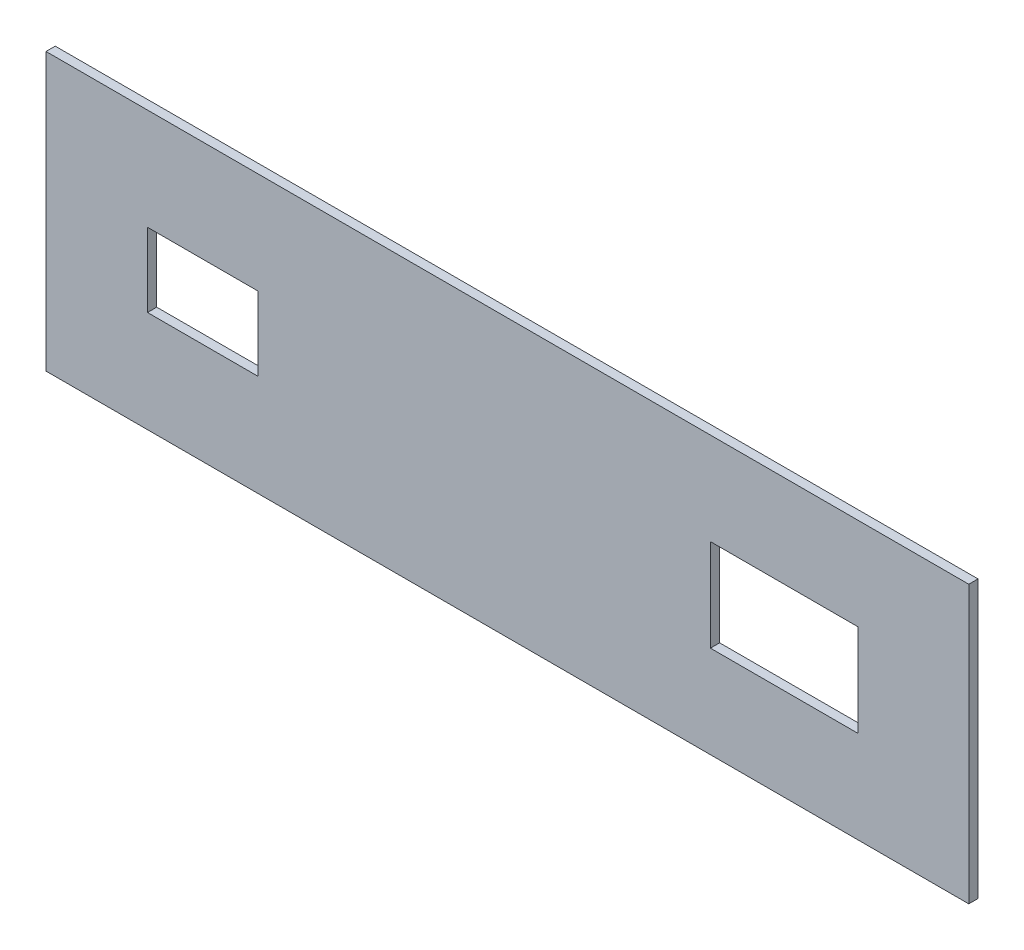
ISO-10303-21;
HEADER;
FILE_DESCRIPTION(('STEP AP214'),'2;1');
FILE_NAME('part.step','',(''),(''),'','','');
FILE_SCHEMA(('AUTOMOTIVE_DESIGN { 1 0 10303 214 1 1 1 1 }'));
ENDSEC;
DATA;
#1=APPLICATION_CONTEXT('core data for automotive mechanical design processes');
#2=APPLICATION_PROTOCOL_DEFINITION('international standard','automotive_design',2000,#1);
#3=PRODUCT_CONTEXT('',#1,'mechanical');
#4=PRODUCT('Part','Part','',(#3));
#5=PRODUCT_RELATED_PRODUCT_CATEGORY('part','',(#4));
#6=PRODUCT_DEFINITION_FORMATION('','',#4);
#7=PRODUCT_DEFINITION_CONTEXT('part definition',#1,'design');
#8=PRODUCT_DEFINITION('design','',#6,#7);
#9=PRODUCT_DEFINITION_SHAPE('','',#8);
#10=(LENGTH_UNIT() NAMED_UNIT(*) SI_UNIT(.MILLI.,.METRE.));
#11=(NAMED_UNIT(*) PLANE_ANGLE_UNIT() SI_UNIT($,.RADIAN.));
#12=(NAMED_UNIT(*) SI_UNIT($,.STERADIAN.) SOLID_ANGLE_UNIT());
#13=UNCERTAINTY_MEASURE_WITH_UNIT(LENGTH_MEASURE(1.E-05),#10,'distance_accuracy_value','');
#14=(GEOMETRIC_REPRESENTATION_CONTEXT(3) GLOBAL_UNCERTAINTY_ASSIGNED_CONTEXT((#13)) GLOBAL_UNIT_ASSIGNED_CONTEXT((#10,
#11,#12)) REPRESENTATION_CONTEXT('',''));
#15=CARTESIAN_POINT('',(0.,0.,0.));
#16=DIRECTION('',(0.,0.,1.));
#17=DIRECTION('',(1.,0.,0.));
#18=AXIS2_PLACEMENT_3D('',#15,#16,#17);
#19=CARTESIAN_POINT('',(0.,0.,5.));
#20=DIRECTION('',(0.,0.,1.));
#21=DIRECTION('',(1.,0.,0.));
#22=AXIS2_PLACEMENT_3D('',#19,#20,#21);
#23=PLANE('',#22);
#24=DIRECTION('',(0.,1.,0.));
#25=VECTOR('',#24,1.);
#26=CARTESIAN_POINT('',(250.,75.,5.));
#27=LINE('',#26,#25);
#28=CARTESIAN_POINT('',(250.,-75.,5.));
#29=VERTEX_POINT('',#28);
#30=CARTESIAN_POINT('',(250.,75.,5.));
#31=VERTEX_POINT('',#30);
#32=EDGE_CURVE('E189',#29,#31,#27,.T.);
#33=ORIENTED_EDGE('',*,*,#32,.T.);
#34=DIRECTION('',(-1.,0.,0.));
#35=VECTOR('',#34,1.);
#36=CARTESIAN_POINT('',(-250.,75.,5.));
#37=LINE('',#36,#35);
#38=CARTESIAN_POINT('',(-250.,75.,5.));
#39=VERTEX_POINT('',#38);
#40=EDGE_CURVE('E192',#31,#39,#37,.T.);
#41=ORIENTED_EDGE('',*,*,#40,.T.);
#42=DIRECTION('',(0.,-1.,0.));
#43=VECTOR('',#42,1.);
#44=CARTESIAN_POINT('',(-250.,75.,5.));
#45=LINE('',#44,#43);
#46=CARTESIAN_POINT('',(-250.,-75.,5.));
#47=VERTEX_POINT('',#46);
#48=EDGE_CURVE('E195',#39,#47,#45,.T.);
#49=ORIENTED_EDGE('',*,*,#48,.T.);
#50=DIRECTION('',(1.,0.,0.));
#51=VECTOR('',#50,1.);
#52=CARTESIAN_POINT('',(-250.,-75.,5.));
#53=LINE('',#52,#51);
#54=EDGE_CURVE('E197',#47,#29,#53,.T.);
#55=ORIENTED_EDGE('',*,*,#54,.T.);
#56=EDGE_LOOP('',(#33,#41,#49,#55));
#57=FACE_BOUND('',#56,.T.);
#58=DIRECTION('',(-1.,0.,0.));
#59=VECTOR('',#58,1.);
#60=CARTESIAN_POINT('',(-195.,20.,5.));
#61=LINE('',#60,#59);
#62=CARTESIAN_POINT('',(-135.,20.,5.));
#63=VERTEX_POINT('',#62);
#64=CARTESIAN_POINT('',(-195.,20.,5.));
#65=VERTEX_POINT('',#64);
#66=EDGE_CURVE('E160',#63,#65,#61,.T.);
#67=ORIENTED_EDGE('',*,*,#66,.F.);
#68=DIRECTION('',(0.,1.,0.));
#69=VECTOR('',#68,1.);
#70=CARTESIAN_POINT('',(-135.,20.,5.));
#71=LINE('',#70,#69);
#72=CARTESIAN_POINT('',(-135.,-20.,5.));
#73=VERTEX_POINT('',#72);
#74=EDGE_CURVE('E158',#73,#63,#71,.T.);
#75=ORIENTED_EDGE('',*,*,#74,.F.);
#76=DIRECTION('',(1.,0.,0.));
#77=VECTOR('',#76,1.);
#78=CARTESIAN_POINT('',(-195.,-20.,5.));
#79=LINE('',#78,#77);
#80=CARTESIAN_POINT('',(-195.,-20.,5.));
#81=VERTEX_POINT('',#80);
#82=EDGE_CURVE('E166',#81,#73,#79,.T.);
#83=ORIENTED_EDGE('',*,*,#82,.F.);
#84=DIRECTION('',(0.,-1.,0.));
#85=VECTOR('',#84,1.);
#86=CARTESIAN_POINT('',(-195.,20.,5.));
#87=LINE('',#86,#85);
#88=EDGE_CURVE('E163',#65,#81,#87,.T.);
#89=ORIENTED_EDGE('',*,*,#88,.F.);
#90=EDGE_LOOP('',(#67,#75,#83,#89));
#91=FACE_BOUND('',#90,.T.);
#92=DIRECTION('',(-1.,0.,0.));
#93=VECTOR('',#92,1.);
#94=CARTESIAN_POINT('',(110.,25.,5.));
#95=LINE('',#94,#93);
#96=CARTESIAN_POINT('',(190.,25.,5.));
#97=VERTEX_POINT('',#96);
#98=CARTESIAN_POINT('',(110.,25.,5.));
#99=VERTEX_POINT('',#98);
#100=EDGE_CURVE('E130',#97,#99,#95,.T.);
#101=ORIENTED_EDGE('',*,*,#100,.F.);
#102=DIRECTION('',(0.,1.,0.));
#103=VECTOR('',#102,1.);
#104=CARTESIAN_POINT('',(190.,25.,5.));
#105=LINE('',#104,#103);
#106=CARTESIAN_POINT('',(190.,-25.,5.));
#107=VERTEX_POINT('',#106);
#108=EDGE_CURVE('E122',#107,#97,#105,.T.);
#109=ORIENTED_EDGE('',*,*,#108,.F.);
#110=DIRECTION('',(1.,0.,0.));
#111=VECTOR('',#110,1.);
#112=CARTESIAN_POINT('',(110.,-25.,5.));
#113=LINE('',#112,#111);
#114=CARTESIAN_POINT('',(110.,-25.,5.));
#115=VERTEX_POINT('',#114);
#116=EDGE_CURVE('E144',#115,#107,#113,.T.);
#117=ORIENTED_EDGE('',*,*,#116,.F.);
#118=DIRECTION('',(0.,-1.,0.));
#119=VECTOR('',#118,1.);
#120=CARTESIAN_POINT('',(110.,25.,5.));
#121=LINE('',#120,#119);
#122=EDGE_CURVE('E142',#99,#115,#121,.T.);
#123=ORIENTED_EDGE('',*,*,#122,.F.);
#124=EDGE_LOOP('',(#101,#109,#117,#123));
#125=FACE_BOUND('',#124,.T.);
#126=ADVANCED_FACE('F33',(#57,#91,#125),#23,.T.);
#127=CARTESIAN_POINT('',(0.,0.,0.));
#128=DIRECTION('',(0.,0.,1.));
#129=DIRECTION('',(1.,0.,0.));
#130=AXIS2_PLACEMENT_3D('',#127,#128,#129);
#131=PLANE('',#130);
#132=DIRECTION('',(0.,1.,0.));
#133=VECTOR('',#132,1.);
#134=CARTESIAN_POINT('',(-135.,20.,0.));
#135=LINE('',#134,#133);
#136=CARTESIAN_POINT('',(-135.,-20.,0.));
#137=VERTEX_POINT('',#136);
#138=CARTESIAN_POINT('',(-135.,20.,0.));
#139=VERTEX_POINT('',#138);
#140=EDGE_CURVE('E138',#137,#139,#135,.T.);
#141=ORIENTED_EDGE('',*,*,#140,.T.);
#142=DIRECTION('',(-1.,0.,0.));
#143=VECTOR('',#142,1.);
#144=CARTESIAN_POINT('',(-195.,20.,0.));
#145=LINE('',#144,#143);
#146=CARTESIAN_POINT('',(-195.,20.,0.));
#147=VERTEX_POINT('',#146);
#148=EDGE_CURVE('E171',#139,#147,#145,.T.);
#149=ORIENTED_EDGE('',*,*,#148,.T.);
#150=DIRECTION('',(0.,-1.,0.));
#151=VECTOR('',#150,1.);
#152=CARTESIAN_POINT('',(-195.,20.,0.));
#153=LINE('',#152,#151);
#154=CARTESIAN_POINT('',(-195.,-20.,0.));
#155=VERTEX_POINT('',#154);
#156=EDGE_CURVE('E174',#147,#155,#153,.T.);
#157=ORIENTED_EDGE('',*,*,#156,.T.);
#158=DIRECTION('',(1.,0.,0.));
#159=VECTOR('',#158,1.);
#160=CARTESIAN_POINT('',(-195.,-20.,0.));
#161=LINE('',#160,#159);
#162=EDGE_CURVE('E161',#155,#137,#161,.T.);
#163=ORIENTED_EDGE('',*,*,#162,.T.);
#164=EDGE_LOOP('',(#141,#149,#157,#163));
#165=FACE_BOUND('',#164,.T.);
#166=DIRECTION('',(0.,1.,0.));
#167=VECTOR('',#166,1.);
#168=CARTESIAN_POINT('',(250.,75.,0.));
#169=LINE('',#168,#167);
#170=CARTESIAN_POINT('',(250.,-75.,0.));
#171=VERTEX_POINT('',#170);
#172=CARTESIAN_POINT('',(250.,75.,0.));
#173=VERTEX_POINT('',#172);
#174=EDGE_CURVE('E188',#171,#173,#169,.T.);
#175=ORIENTED_EDGE('',*,*,#174,.F.);
#176=DIRECTION('',(1.,0.,0.));
#177=VECTOR('',#176,1.);
#178=CARTESIAN_POINT('',(-250.,-75.,0.));
#179=LINE('',#178,#177);
#180=CARTESIAN_POINT('',(-250.,-75.,0.));
#181=VERTEX_POINT('',#180);
#182=EDGE_CURVE('E193',#181,#171,#179,.T.);
#183=ORIENTED_EDGE('',*,*,#182,.F.);
#184=DIRECTION('',(0.,-1.,0.));
#185=VECTOR('',#184,1.);
#186=CARTESIAN_POINT('',(-250.,75.,0.));
#187=LINE('',#186,#185);
#188=CARTESIAN_POINT('',(-250.,75.,0.));
#189=VERTEX_POINT('',#188);
#190=EDGE_CURVE('E204',#189,#181,#187,.T.);
#191=ORIENTED_EDGE('',*,*,#190,.F.);
#192=DIRECTION('',(-1.,0.,0.));
#193=VECTOR('',#192,1.);
#194=CARTESIAN_POINT('',(-250.,75.,0.));
#195=LINE('',#194,#193);
#196=EDGE_CURVE('E202',#173,#189,#195,.T.);
#197=ORIENTED_EDGE('',*,*,#196,.F.);
#198=EDGE_LOOP('',(#175,#183,#191,#197));
#199=FACE_BOUND('',#198,.T.);
#200=DIRECTION('',(0.,1.,0.));
#201=VECTOR('',#200,1.);
#202=CARTESIAN_POINT('',(190.,25.,0.));
#203=LINE('',#202,#201);
#204=CARTESIAN_POINT('',(190.,-25.,0.));
#205=VERTEX_POINT('',#204);
#206=CARTESIAN_POINT('',(190.,25.,0.));
#207=VERTEX_POINT('',#206);
#208=EDGE_CURVE('E56',#205,#207,#203,.T.);
#209=ORIENTED_EDGE('',*,*,#208,.T.);
#210=DIRECTION('',(-1.,0.,0.));
#211=VECTOR('',#210,1.);
#212=CARTESIAN_POINT('',(110.,25.,0.));
#213=LINE('',#212,#211);
#214=CARTESIAN_POINT('',(110.,25.,0.));
#215=VERTEX_POINT('',#214);
#216=EDGE_CURVE('E137',#207,#215,#213,.T.);
#217=ORIENTED_EDGE('',*,*,#216,.T.);
#218=DIRECTION('',(0.,-1.,0.));
#219=VECTOR('',#218,1.);
#220=CARTESIAN_POINT('',(110.,25.,0.));
#221=LINE('',#220,#219);
#222=CARTESIAN_POINT('',(110.,-25.,0.));
#223=VERTEX_POINT('',#222);
#224=EDGE_CURVE('E150',#215,#223,#221,.T.);
#225=ORIENTED_EDGE('',*,*,#224,.T.);
#226=DIRECTION('',(1.,0.,0.));
#227=VECTOR('',#226,1.);
#228=CARTESIAN_POINT('',(110.,-25.,0.));
#229=LINE('',#228,#227);
#230=EDGE_CURVE('E131',#223,#205,#229,.T.);
#231=ORIENTED_EDGE('',*,*,#230,.T.);
#232=EDGE_LOOP('',(#209,#217,#225,#231));
#233=FACE_BOUND('',#232,.T.);
#234=ADVANCED_FACE('F222',(#165,#199,#233),#131,.F.);
#235=CARTESIAN_POINT('',(250.,75.,5.));
#236=DIRECTION('',(-1.,0.,0.));
#237=DIRECTION('',(0.,0.,1.));
#238=AXIS2_PLACEMENT_3D('',#235,#236,#237);
#239=PLANE('',#238);
#240=ORIENTED_EDGE('',*,*,#174,.T.);
#241=DIRECTION('',(0.,0.,-1.));
#242=VECTOR('',#241,1.);
#243=CARTESIAN_POINT('',(250.,75.,5.));
#244=LINE('',#243,#242);
#245=EDGE_CURVE('E11',#31,#173,#244,.T.);
#246=ORIENTED_EDGE('',*,*,#245,.F.);
#247=ORIENTED_EDGE('',*,*,#32,.F.);
#248=DIRECTION('',(0.,0.,-1.));
#249=VECTOR('',#248,1.);
#250=CARTESIAN_POINT('',(250.,-75.,5.));
#251=LINE('',#250,#249);
#252=EDGE_CURVE('E199',#29,#171,#251,.T.);
#253=ORIENTED_EDGE('',*,*,#252,.T.);
#254=EDGE_LOOP('',(#240,#246,#247,#253));
#255=FACE_BOUND('',#254,.T.);
#256=ADVANCED_FACE('F35',(#255),#239,.F.);
#257=CARTESIAN_POINT('',(-250.,75.,5.));
#258=DIRECTION('',(0.,-1.,0.));
#259=DIRECTION('',(0.,0.,-1.));
#260=AXIS2_PLACEMENT_3D('',#257,#258,#259);
#261=PLANE('',#260);
#262=ORIENTED_EDGE('',*,*,#196,.T.);
#263=DIRECTION('',(0.,0.,-1.));
#264=VECTOR('',#263,1.);
#265=CARTESIAN_POINT('',(-250.,75.,5.));
#266=LINE('',#265,#264);
#267=EDGE_CURVE('E41',#39,#189,#266,.T.);
#268=ORIENTED_EDGE('',*,*,#267,.F.);
#269=ORIENTED_EDGE('',*,*,#40,.F.);
#270=ORIENTED_EDGE('',*,*,#245,.T.);
#271=EDGE_LOOP('',(#262,#268,#269,#270));
#272=FACE_BOUND('',#271,.T.);
#273=ADVANCED_FACE('F233',(#272),#261,.F.);
#274=CARTESIAN_POINT('',(-250.,75.,5.));
#275=DIRECTION('',(1.,0.,0.));
#276=DIRECTION('',(0.,1.,0.));
#277=AXIS2_PLACEMENT_3D('',#274,#275,#276);
#278=PLANE('',#277);
#279=ORIENTED_EDGE('',*,*,#190,.T.);
#280=DIRECTION('',(0.,0.,-1.));
#281=VECTOR('',#280,1.);
#282=CARTESIAN_POINT('',(-250.,-75.,5.));
#283=LINE('',#282,#281);
#284=EDGE_CURVE('E209',#47,#181,#283,.T.);
#285=ORIENTED_EDGE('',*,*,#284,.F.);
#286=ORIENTED_EDGE('',*,*,#48,.F.);
#287=ORIENTED_EDGE('',*,*,#267,.T.);
#288=EDGE_LOOP('',(#279,#285,#286,#287));
#289=FACE_BOUND('',#288,.T.);
#290=ADVANCED_FACE('F216',(#289),#278,.F.);
#291=CARTESIAN_POINT('',(-250.,-75.,5.));
#292=DIRECTION('',(0.,1.,0.));
#293=DIRECTION('',(0.,0.,1.));
#294=AXIS2_PLACEMENT_3D('',#291,#292,#293);
#295=PLANE('',#294);
#296=ORIENTED_EDGE('',*,*,#182,.T.);
#297=ORIENTED_EDGE('',*,*,#252,.F.);
#298=ORIENTED_EDGE('',*,*,#54,.F.);
#299=ORIENTED_EDGE('',*,*,#284,.T.);
#300=EDGE_LOOP('',(#296,#297,#298,#299));
#301=FACE_BOUND('',#300,.T.);
#302=ADVANCED_FACE('F226',(#301),#295,.F.);
#303=CARTESIAN_POINT('',(-135.,20.,5.));
#304=DIRECTION('',(-1.,0.,0.));
#305=DIRECTION('',(0.,0.,1.));
#306=AXIS2_PLACEMENT_3D('',#303,#304,#305);
#307=PLANE('',#306);
#308=ORIENTED_EDGE('',*,*,#140,.F.);
#309=DIRECTION('',(0.,0.,-1.));
#310=VECTOR('',#309,1.);
#311=CARTESIAN_POINT('',(-135.,-20.,5.));
#312=LINE('',#311,#310);
#313=EDGE_CURVE('E168',#73,#137,#312,.T.);
#314=ORIENTED_EDGE('',*,*,#313,.F.);
#315=ORIENTED_EDGE('',*,*,#74,.T.);
#316=DIRECTION('',(0.,0.,-1.));
#317=VECTOR('',#316,1.);
#318=CARTESIAN_POINT('',(-135.,20.,5.));
#319=LINE('',#318,#317);
#320=EDGE_CURVE('E185',#63,#139,#319,.T.);
#321=ORIENTED_EDGE('',*,*,#320,.T.);
#322=EDGE_LOOP('',(#308,#314,#315,#321));
#323=FACE_BOUND('',#322,.T.);
#324=ADVANCED_FACE('F248',(#323),#307,.T.);
#325=CARTESIAN_POINT('',(-195.,20.,5.));
#326=DIRECTION('',(0.,-1.,0.));
#327=DIRECTION('',(0.,0.,-1.));
#328=AXIS2_PLACEMENT_3D('',#325,#326,#327);
#329=PLANE('',#328);
#330=ORIENTED_EDGE('',*,*,#148,.F.);
#331=ORIENTED_EDGE('',*,*,#320,.F.);
#332=ORIENTED_EDGE('',*,*,#66,.T.);
#333=DIRECTION('',(0.,0.,-1.));
#334=VECTOR('',#333,1.);
#335=CARTESIAN_POINT('',(-195.,20.,5.));
#336=LINE('',#335,#334);
#337=EDGE_CURVE('E183',#65,#147,#336,.T.);
#338=ORIENTED_EDGE('',*,*,#337,.T.);
#339=EDGE_LOOP('',(#330,#331,#332,#338));
#340=FACE_BOUND('',#339,.T.);
#341=ADVANCED_FACE('F255',(#340),#329,.T.);
#342=CARTESIAN_POINT('',(-195.,20.,5.));
#343=DIRECTION('',(1.,0.,0.));
#344=DIRECTION('',(0.,0.,-1.));
#345=AXIS2_PLACEMENT_3D('',#342,#343,#344);
#346=PLANE('',#345);
#347=ORIENTED_EDGE('',*,*,#156,.F.);
#348=ORIENTED_EDGE('',*,*,#337,.F.);
#349=ORIENTED_EDGE('',*,*,#88,.T.);
#350=DIRECTION('',(0.,0.,-1.));
#351=VECTOR('',#350,1.);
#352=CARTESIAN_POINT('',(-195.,-20.,5.));
#353=LINE('',#352,#351);
#354=EDGE_CURVE('E181',#81,#155,#353,.T.);
#355=ORIENTED_EDGE('',*,*,#354,.T.);
#356=EDGE_LOOP('',(#347,#348,#349,#355));
#357=FACE_BOUND('',#356,.T.);
#358=ADVANCED_FACE('F260',(#357),#346,.T.);
#359=CARTESIAN_POINT('',(-195.,-20.,5.));
#360=DIRECTION('',(0.,1.,0.));
#361=DIRECTION('',(0.,0.,1.));
#362=AXIS2_PLACEMENT_3D('',#359,#360,#361);
#363=PLANE('',#362);
#364=ORIENTED_EDGE('',*,*,#162,.F.);
#365=ORIENTED_EDGE('',*,*,#354,.F.);
#366=ORIENTED_EDGE('',*,*,#82,.T.);
#367=ORIENTED_EDGE('',*,*,#313,.T.);
#368=EDGE_LOOP('',(#364,#365,#366,#367));
#369=FACE_BOUND('',#368,.T.);
#370=ADVANCED_FACE('F267',(#369),#363,.T.);
#371=CARTESIAN_POINT('',(190.,25.,5.));
#372=DIRECTION('',(-1.,0.,0.));
#373=DIRECTION('',(0.,0.,1.));
#374=AXIS2_PLACEMENT_3D('',#371,#372,#373);
#375=PLANE('',#374);
#376=ORIENTED_EDGE('',*,*,#208,.F.);
#377=DIRECTION('',(0.,0.,-1.));
#378=VECTOR('',#377,1.);
#379=CARTESIAN_POINT('',(190.,-25.,5.));
#380=LINE('',#379,#378);
#381=EDGE_CURVE('E126',#107,#205,#380,.T.);
#382=ORIENTED_EDGE('',*,*,#381,.F.);
#383=ORIENTED_EDGE('',*,*,#108,.T.);
#384=DIRECTION('',(0.,0.,-1.));
#385=VECTOR('',#384,1.);
#386=CARTESIAN_POINT('',(190.,25.,5.));
#387=LINE('',#386,#385);
#388=EDGE_CURVE('E125',#97,#207,#387,.T.);
#389=ORIENTED_EDGE('',*,*,#388,.T.);
#390=EDGE_LOOP('',(#376,#382,#383,#389));
#391=FACE_BOUND('',#390,.T.);
#392=ADVANCED_FACE('F124',(#391),#375,.T.);
#393=CARTESIAN_POINT('',(110.,25.,5.));
#394=DIRECTION('',(0.,-1.,0.));
#395=DIRECTION('',(0.,0.,-1.));
#396=AXIS2_PLACEMENT_3D('',#393,#394,#395);
#397=PLANE('',#396);
#398=ORIENTED_EDGE('',*,*,#216,.F.);
#399=ORIENTED_EDGE('',*,*,#388,.F.);
#400=ORIENTED_EDGE('',*,*,#100,.T.);
#401=DIRECTION('',(0.,0.,-1.));
#402=VECTOR('',#401,1.);
#403=CARTESIAN_POINT('',(110.,25.,5.));
#404=LINE('',#403,#402);
#405=EDGE_CURVE('E139',#99,#215,#404,.T.);
#406=ORIENTED_EDGE('',*,*,#405,.T.);
#407=EDGE_LOOP('',(#398,#399,#400,#406));
#408=FACE_BOUND('',#407,.T.);
#409=ADVANCED_FACE('F134',(#408),#397,.T.);
#410=CARTESIAN_POINT('',(110.,25.,5.));
#411=DIRECTION('',(1.,0.,0.));
#412=DIRECTION('',(0.,0.,-1.));
#413=AXIS2_PLACEMENT_3D('',#410,#411,#412);
#414=PLANE('',#413);
#415=ORIENTED_EDGE('',*,*,#224,.F.);
#416=ORIENTED_EDGE('',*,*,#405,.F.);
#417=ORIENTED_EDGE('',*,*,#122,.T.);
#418=DIRECTION('',(0.,0.,-1.));
#419=VECTOR('',#418,1.);
#420=CARTESIAN_POINT('',(110.,-25.,5.));
#421=LINE('',#420,#419);
#422=EDGE_CURVE('E48',#115,#223,#421,.T.);
#423=ORIENTED_EDGE('',*,*,#422,.T.);
#424=EDGE_LOOP('',(#415,#416,#417,#423));
#425=FACE_BOUND('',#424,.T.);
#426=ADVANCED_FACE('F285',(#425),#414,.T.);
#427=CARTESIAN_POINT('',(110.,-25.,5.));
#428=DIRECTION('',(0.,1.,0.));
#429=DIRECTION('',(0.,0.,1.));
#430=AXIS2_PLACEMENT_3D('',#427,#428,#429);
#431=PLANE('',#430);
#432=ORIENTED_EDGE('',*,*,#230,.F.);
#433=ORIENTED_EDGE('',*,*,#422,.F.);
#434=ORIENTED_EDGE('',*,*,#116,.T.);
#435=ORIENTED_EDGE('',*,*,#381,.T.);
#436=EDGE_LOOP('',(#432,#433,#434,#435));
#437=FACE_BOUND('',#436,.T.);
#438=ADVANCED_FACE('F288',(#437),#431,.T.);
#439=CLOSED_SHELL('',(#126,#234,#256,#273,#290,#302,#324,#341,#358,#370,#392,#409,#426,#438));
#440=MANIFOLD_SOLID_BREP('B2',#439);
#441=ADVANCED_BREP_SHAPE_REPRESENTATION('',(#18,#440),#14);
#442=SHAPE_DEFINITION_REPRESENTATION(#9,#441);
ENDSEC;
END-ISO-10303-21;
